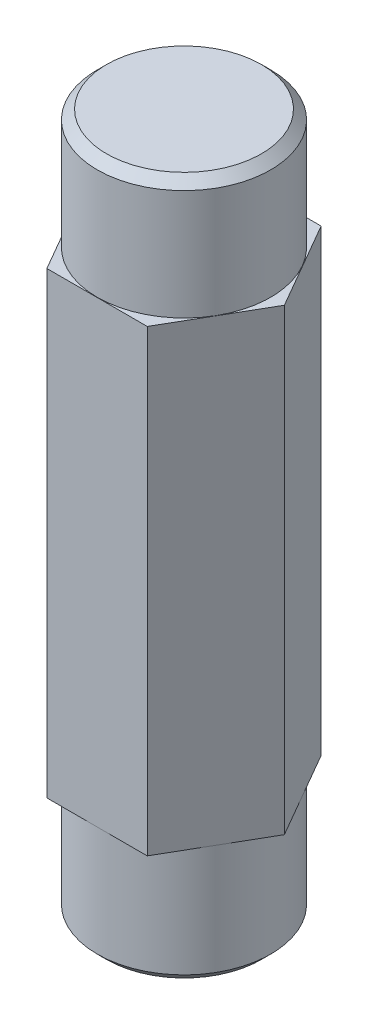
ISO-10303-21;
HEADER;
FILE_DESCRIPTION(('STEP AP214'),'2;1');
FILE_NAME('part.step','',(''),(''),'','','');
FILE_SCHEMA(('AUTOMOTIVE_DESIGN { 1 0 10303 214 1 1 1 1 }'));
ENDSEC;
DATA;
#1=APPLICATION_CONTEXT('core data for automotive mechanical design processes');
#2=APPLICATION_PROTOCOL_DEFINITION('international standard','automotive_design',2000,#1);
#3=PRODUCT_CONTEXT('',#1,'mechanical');
#4=PRODUCT('Part','Part','',(#3));
#5=PRODUCT_RELATED_PRODUCT_CATEGORY('part','',(#4));
#6=PRODUCT_DEFINITION_FORMATION('','',#4);
#7=PRODUCT_DEFINITION_CONTEXT('part definition',#1,'design');
#8=PRODUCT_DEFINITION('design','',#6,#7);
#9=PRODUCT_DEFINITION_SHAPE('','',#8);
#10=(LENGTH_UNIT() NAMED_UNIT(*) SI_UNIT(.MILLI.,.METRE.));
#11=(NAMED_UNIT(*) PLANE_ANGLE_UNIT() SI_UNIT($,.RADIAN.));
#12=(NAMED_UNIT(*) SI_UNIT($,.STERADIAN.) SOLID_ANGLE_UNIT());
#13=UNCERTAINTY_MEASURE_WITH_UNIT(LENGTH_MEASURE(1.E-05),#10,'distance_accuracy_value','');
#14=(GEOMETRIC_REPRESENTATION_CONTEXT(3) GLOBAL_UNCERTAINTY_ASSIGNED_CONTEXT((#13)) GLOBAL_UNIT_ASSIGNED_CONTEXT((#10,
#11,#12)) REPRESENTATION_CONTEXT('',''));
#15=CARTESIAN_POINT('',(0.,0.,0.));
#16=DIRECTION('',(0.,0.,1.));
#17=DIRECTION('',(1.,0.,0.));
#18=AXIS2_PLACEMENT_3D('',#15,#16,#17);
#19=CARTESIAN_POINT('',(-44.7233856342443,-25.527,-16.6661167863655));
#20=DIRECTION('',(-0.866025403784439,0.,0.5));
#21=DIRECTION('',(0.5,0.,0.866025403784439));
#22=AXIS2_PLACEMENT_3D('',#19,#20,#21);
#23=PLANE('',#22);
#24=DIRECTION('',(0.,1.,0.));
#25=VECTOR('',#24,1.);
#26=CARTESIAN_POINT('',(-41.9737549772287,-25.527,-11.9036167863655));
#27=LINE('',#26,#25);
#28=CARTESIAN_POINT('',(-41.9737549772287,-25.3238,-11.9036167863655));
#29=VERTEX_POINT('',#28);
#30=CARTESIAN_POINT('',(-41.9737549772287,-0.2032,-11.9036167863655));
#31=VERTEX_POINT('',#30);
#32=EDGE_CURVE('E115',#29,#31,#27,.T.);
#33=ORIENTED_EDGE('',*,*,#32,.T.);
#34=DIRECTION('',(0.5,0.,0.866025403784439));
#35=VECTOR('',#34,1.);
#36=CARTESIAN_POINT('',(-44.7233856342443,-0.2032,-16.6661167863655));
#37=LINE('',#36,#35);
#38=CARTESIAN_POINT('',(-44.7233856342443,-0.2032,-16.6661167863655));
#39=VERTEX_POINT('',#38);
#40=EDGE_CURVE('E102',#39,#31,#37,.T.);
#41=ORIENTED_EDGE('',*,*,#40,.F.);
#42=DIRECTION('',(0.,1.,0.));
#43=VECTOR('',#42,1.);
#44=CARTESIAN_POINT('',(-44.7233856342443,-25.527,-16.6661167863655));
#45=LINE('',#44,#43);
#46=CARTESIAN_POINT('',(-44.7233856342443,-25.3238,-16.6661167863655));
#47=VERTEX_POINT('',#46);
#48=EDGE_CURVE('E113',#47,#39,#45,.T.);
#49=ORIENTED_EDGE('',*,*,#48,.F.);
#50=DIRECTION('',(-0.5,0.,-0.866025403784439));
#51=VECTOR('',#50,1.);
#52=CARTESIAN_POINT('',(-41.9737549772287,-25.3238,-11.9036167863655));
#53=LINE('',#52,#51);
#54=EDGE_CURVE('E72',#29,#47,#53,.T.);
#55=ORIENTED_EDGE('',*,*,#54,.F.);
#56=EDGE_LOOP('',(#33,#41,#49,#55));
#57=FACE_BOUND('',#56,.T.);
#58=ADVANCED_FACE('F50',(#57),#23,.T.);
#59=CARTESIAN_POINT('',(-41.9737549772287,-25.527,-11.9036167863655));
#60=DIRECTION('',(0.,0.,1.));
#61=DIRECTION('',(1.,0.,0.));
#62=AXIS2_PLACEMENT_3D('',#59,#60,#61);
#63=PLANE('',#62);
#64=DIRECTION('',(0.,1.,0.));
#65=VECTOR('',#64,1.);
#66=CARTESIAN_POINT('',(-36.4744936631975,-25.527,-11.9036167863655));
#67=LINE('',#66,#65);
#68=CARTESIAN_POINT('',(-36.4744936631975,-25.3238,-11.9036167863655));
#69=VERTEX_POINT('',#68);
#70=CARTESIAN_POINT('',(-36.4744936631975,-0.2032,-11.9036167863655));
#71=VERTEX_POINT('',#70);
#72=EDGE_CURVE('E134',#69,#71,#67,.T.);
#73=ORIENTED_EDGE('',*,*,#72,.T.);
#74=DIRECTION('',(1.,0.,0.));
#75=VECTOR('',#74,1.);
#76=CARTESIAN_POINT('',(-41.9737549772287,-0.2032,-11.9036167863655));
#77=LINE('',#76,#75);
#78=EDGE_CURVE('E116',#31,#71,#77,.T.);
#79=ORIENTED_EDGE('',*,*,#78,.F.);
#80=ORIENTED_EDGE('',*,*,#32,.F.);
#81=DIRECTION('',(-1.,0.,0.));
#82=VECTOR('',#81,1.);
#83=CARTESIAN_POINT('',(-36.4744936631975,-25.3238,-11.9036167863655));
#84=LINE('',#83,#82);
#85=EDGE_CURVE('E218',#69,#29,#84,.T.);
#86=ORIENTED_EDGE('',*,*,#85,.F.);
#87=EDGE_LOOP('',(#73,#79,#80,#86));
#88=FACE_BOUND('',#87,.T.);
#89=ADVANCED_FACE('F166',(#88),#63,.T.);
#90=CARTESIAN_POINT('',(-36.4744936631975,-25.527,-11.9036167863655));
#91=DIRECTION('',(0.866025403784438,0.,0.500000000000001));
#92=DIRECTION('',(0.500000000000001,0.,-0.866025403784438));
#93=AXIS2_PLACEMENT_3D('',#90,#91,#92);
#94=PLANE('',#93);
#95=DIRECTION('',(0.,1.,0.));
#96=VECTOR('',#95,1.);
#97=CARTESIAN_POINT('',(-33.7248630061819,-25.527,-16.6661167863655));
#98=LINE('',#97,#96);
#99=CARTESIAN_POINT('',(-33.7248630061819,-25.3238,-16.6661167863655));
#100=VERTEX_POINT('',#99);
#101=CARTESIAN_POINT('',(-33.7248630061819,-0.2032,-16.6661167863655));
#102=VERTEX_POINT('',#101);
#103=EDGE_CURVE('E131',#100,#102,#98,.T.);
#104=ORIENTED_EDGE('',*,*,#103,.T.);
#105=DIRECTION('',(0.500000000000001,0.,-0.866025403784438));
#106=VECTOR('',#105,1.);
#107=CARTESIAN_POINT('',(-36.4744936631975,-0.2032,-11.9036167863655));
#108=LINE('',#107,#106);
#109=EDGE_CURVE('E210',#71,#102,#108,.T.);
#110=ORIENTED_EDGE('',*,*,#109,.F.);
#111=ORIENTED_EDGE('',*,*,#72,.F.);
#112=DIRECTION('',(-0.500000000000001,0.,0.866025403784438));
#113=VECTOR('',#112,1.);
#114=CARTESIAN_POINT('',(-33.7248630061819,-25.3238,-16.6661167863655));
#115=LINE('',#114,#113);
#116=EDGE_CURVE('E121',#100,#69,#115,.T.);
#117=ORIENTED_EDGE('',*,*,#116,.F.);
#118=EDGE_LOOP('',(#104,#110,#111,#117));
#119=FACE_BOUND('',#118,.T.);
#120=ADVANCED_FACE('F170',(#119),#94,.T.);
#121=CARTESIAN_POINT('',(-33.7248630061819,-25.527,-16.6661167863655));
#122=DIRECTION('',(0.866025403784439,0.,-0.5));
#123=DIRECTION('',(-0.5,0.,-0.866025403784439));
#124=AXIS2_PLACEMENT_3D('',#121,#122,#123);
#125=PLANE('',#124);
#126=DIRECTION('',(0.,1.,0.));
#127=VECTOR('',#126,1.);
#128=CARTESIAN_POINT('',(-36.4744936631975,-25.527,-21.4286167863655));
#129=LINE('',#128,#127);
#130=CARTESIAN_POINT('',(-36.4744936631975,-25.3238,-21.4286167863655));
#131=VERTEX_POINT('',#130);
#132=CARTESIAN_POINT('',(-36.4744936631975,-0.2032,-21.4286167863655));
#133=VERTEX_POINT('',#132);
#134=EDGE_CURVE('E123',#131,#133,#129,.T.);
#135=ORIENTED_EDGE('',*,*,#134,.T.);
#136=DIRECTION('',(-0.5,0.,-0.866025403784439));
#137=VECTOR('',#136,1.);
#138=CARTESIAN_POINT('',(-33.7248630061819,-0.2032,-16.6661167863655));
#139=LINE('',#138,#137);
#140=EDGE_CURVE('E212',#102,#133,#139,.T.);
#141=ORIENTED_EDGE('',*,*,#140,.F.);
#142=ORIENTED_EDGE('',*,*,#103,.F.);
#143=DIRECTION('',(0.5,0.,0.866025403784439));
#144=VECTOR('',#143,1.);
#145=CARTESIAN_POINT('',(-36.4744936631975,-25.3238,-21.4286167863655));
#146=LINE('',#145,#144);
#147=EDGE_CURVE('E125',#131,#100,#146,.T.);
#148=ORIENTED_EDGE('',*,*,#147,.F.);
#149=EDGE_LOOP('',(#135,#141,#142,#148));
#150=FACE_BOUND('',#149,.T.);
#151=ADVANCED_FACE('F175',(#150),#125,.T.);
#152=CARTESIAN_POINT('',(-36.4744936631975,-25.527,-21.4286167863655));
#153=DIRECTION('',(0.,0.,-1.));
#154=DIRECTION('',(-1.,0.,0.));
#155=AXIS2_PLACEMENT_3D('',#152,#153,#154);
#156=PLANE('',#155);
#157=DIRECTION('',(0.,1.,0.));
#158=VECTOR('',#157,1.);
#159=CARTESIAN_POINT('',(-41.9737549772287,-25.527,-21.4286167863655));
#160=LINE('',#159,#158);
#161=CARTESIAN_POINT('',(-41.9737549772287,-25.3238,-21.4286167863655));
#162=VERTEX_POINT('',#161);
#163=CARTESIAN_POINT('',(-41.9737549772287,-0.203200000000001,-21.4286167863655));
#164=VERTEX_POINT('',#163);
#165=EDGE_CURVE('E120',#162,#164,#160,.T.);
#166=ORIENTED_EDGE('',*,*,#165,.T.);
#167=DIRECTION('',(-1.,0.,0.));
#168=VECTOR('',#167,1.);
#169=CARTESIAN_POINT('',(-36.4744936631975,-0.2032,-21.4286167863655));
#170=LINE('',#169,#168);
#171=EDGE_CURVE('E64',#133,#164,#170,.T.);
#172=ORIENTED_EDGE('',*,*,#171,.F.);
#173=ORIENTED_EDGE('',*,*,#134,.F.);
#174=DIRECTION('',(1.,0.,0.));
#175=VECTOR('',#174,1.);
#176=CARTESIAN_POINT('',(-41.9737549772287,-25.3238,-21.4286167863655));
#177=LINE('',#176,#175);
#178=EDGE_CURVE('E222',#162,#131,#177,.T.);
#179=ORIENTED_EDGE('',*,*,#178,.F.);
#180=EDGE_LOOP('',(#166,#172,#173,#179));
#181=FACE_BOUND('',#180,.T.);
#182=ADVANCED_FACE('F181',(#181),#156,.T.);
#183=CARTESIAN_POINT('',(-41.9737549772287,-25.527,-21.4286167863655));
#184=DIRECTION('',(-0.866025403784438,0.,-0.500000000000001));
#185=DIRECTION('',(-0.500000000000001,0.,0.866025403784438));
#186=AXIS2_PLACEMENT_3D('',#183,#184,#185);
#187=PLANE('',#186);
#188=ORIENTED_EDGE('',*,*,#48,.T.);
#189=DIRECTION('',(-0.500000000000001,0.,0.866025403784438));
#190=VECTOR('',#189,1.);
#191=CARTESIAN_POINT('',(-41.9737549772287,-0.2032,-21.4286167863655));
#192=LINE('',#191,#190);
#193=EDGE_CURVE('E99',#164,#39,#192,.T.);
#194=ORIENTED_EDGE('',*,*,#193,.F.);
#195=ORIENTED_EDGE('',*,*,#165,.F.);
#196=DIRECTION('',(0.500000000000001,0.,-0.866025403784438));
#197=VECTOR('',#196,1.);
#198=CARTESIAN_POINT('',(-44.7233856342443,-25.3238,-16.6661167863655));
#199=LINE('',#198,#197);
#200=EDGE_CURVE('E119',#47,#162,#199,.T.);
#201=ORIENTED_EDGE('',*,*,#200,.F.);
#202=EDGE_LOOP('',(#188,#194,#195,#201));
#203=FACE_BOUND('',#202,.T.);
#204=ADVANCED_FACE('F118',(#203),#187,.T.);
#205=CARTESIAN_POINT('',(-41.9737549772287,-25.3238,-11.9036167863655));
#206=DIRECTION('',(0.,-1.,0.));
#207=DIRECTION('',(0.,0.,-1.));
#208=AXIS2_PLACEMENT_3D('',#205,#206,#207);
#209=PLANE('',#208);
#210=CARTESIAN_POINT('',(-39.2241243202131,-25.3238,-16.6661167863655));
#211=DIRECTION('',(0.,-1.,0.));
#212=DIRECTION('',(0.,0.,-1.));
#213=AXIS2_PLACEMENT_3D('',#210,#211,#212);
#214=CIRCLE('',#213,4.7498);
#215=CARTESIAN_POINT('',(-39.2241243202131,-25.3238,-21.4159167863655));
#216=VERTEX_POINT('',#215);
#217=EDGE_CURVE('E215',#216,#216,#214,.T.);
#218=ORIENTED_EDGE('',*,*,#217,.F.);
#219=EDGE_LOOP('',(#218));
#220=FACE_BOUND('',#219,.T.);
#221=ORIENTED_EDGE('',*,*,#85,.T.);
#222=ORIENTED_EDGE('',*,*,#54,.T.);
#223=ORIENTED_EDGE('',*,*,#200,.T.);
#224=ORIENTED_EDGE('',*,*,#178,.T.);
#225=ORIENTED_EDGE('',*,*,#147,.T.);
#226=ORIENTED_EDGE('',*,*,#116,.T.);
#227=EDGE_LOOP('',(#221,#222,#223,#224,#225,#226));
#228=FACE_BOUND('',#227,.T.);
#229=ADVANCED_FACE('F159',(#220,#228),#209,.T.);
#230=CARTESIAN_POINT('',(-39.2241243202131,-31.877,-16.6661167863655));
#231=DIRECTION('',(0.,1.,0.));
#232=DIRECTION('',(0.,0.,1.));
#233=AXIS2_PLACEMENT_3D('',#230,#231,#232);
#234=PLANE('',#233);
#235=CARTESIAN_POINT('',(-39.2241243202131,-31.877,-16.6661167863655));
#236=DIRECTION('',(0.,1.,0.));
#237=DIRECTION('',(0.,0.,1.));
#238=AXIS2_PLACEMENT_3D('',#235,#236,#237);
#239=CIRCLE('',#238,4.2418);
#240=CARTESIAN_POINT('',(-39.2241243202131,-31.877,-12.4243167863655));
#241=VERTEX_POINT('',#240);
#242=EDGE_CURVE('E11',#241,#241,#239,.F.);
#243=ORIENTED_EDGE('',*,*,#242,.T.);
#244=EDGE_LOOP('',(#243));
#245=FACE_BOUND('',#244,.T.);
#246=ADVANCED_FACE('F151',(#245),#234,.F.);
#247=CARTESIAN_POINT('',(-39.2241243202131,-31.369,-16.6661167863655));
#248=DIRECTION('',(0.,1.,0.));
#249=DIRECTION('',(0.,0.,1.));
#250=AXIS2_PLACEMENT_3D('',#247,#248,#249);
#251=CONICAL_SURFACE('',#250,4.7498,0.78539816339745);
#252=ORIENTED_EDGE('',*,*,#242,.F.);
#253=EDGE_LOOP('',(#252));
#254=FACE_BOUND('',#253,.T.);
#255=CARTESIAN_POINT('',(-39.2241243202131,-31.369,-16.6661167863655));
#256=DIRECTION('',(0.,1.,0.));
#257=DIRECTION('',(0.,0.,1.));
#258=AXIS2_PLACEMENT_3D('',#255,#256,#257);
#259=CIRCLE('',#258,4.7498);
#260=CARTESIAN_POINT('',(-39.2241243202131,-31.369,-11.9163167863655));
#261=VERTEX_POINT('',#260);
#262=EDGE_CURVE('E57',#261,#261,#259,.T.);
#263=ORIENTED_EDGE('',*,*,#262,.F.);
#264=EDGE_LOOP('',(#263));
#265=FACE_BOUND('',#264,.T.);
#266=ADVANCED_FACE('F149',(#254,#265),#251,.T.);
#267=CARTESIAN_POINT('',(-39.2241243202131,-31.877,-16.6661167863655));
#268=DIRECTION('',(0.,1.,0.));
#269=DIRECTION('',(0.,0.,1.));
#270=AXIS2_PLACEMENT_3D('',#267,#268,#269);
#271=CYLINDRICAL_SURFACE('',#270,4.7498);
#272=ORIENTED_EDGE('',*,*,#262,.T.);
#273=EDGE_LOOP('',(#272));
#274=FACE_BOUND('',#273,.T.);
#275=ORIENTED_EDGE('',*,*,#217,.T.);
#276=EDGE_LOOP('',(#275));
#277=FACE_BOUND('',#276,.T.);
#278=ADVANCED_FACE('F146',(#274,#277),#271,.T.);
#279=CARTESIAN_POINT('',(-44.7233856342443,-0.2032,-16.6661167863655));
#280=DIRECTION('',(0.,1.,0.));
#281=DIRECTION('',(0.,0.,1.));
#282=AXIS2_PLACEMENT_3D('',#279,#280,#281);
#283=PLANE('',#282);
#284=CARTESIAN_POINT('',(-39.2241243202131,-0.2032,-16.6661167863655));
#285=DIRECTION('',(0.,1.,0.));
#286=DIRECTION('',(0.,0.,1.));
#287=AXIS2_PLACEMENT_3D('',#284,#285,#286);
#288=CIRCLE('',#287,4.7498);
#289=CARTESIAN_POINT('',(-39.2241243202131,-0.2032,-11.9163167863655));
#290=VERTEX_POINT('',#289);
#291=EDGE_CURVE('E108',#290,#290,#288,.T.);
#292=ORIENTED_EDGE('',*,*,#291,.F.);
#293=EDGE_LOOP('',(#292));
#294=FACE_BOUND('',#293,.T.);
#295=ORIENTED_EDGE('',*,*,#193,.T.);
#296=ORIENTED_EDGE('',*,*,#40,.T.);
#297=ORIENTED_EDGE('',*,*,#78,.T.);
#298=ORIENTED_EDGE('',*,*,#109,.T.);
#299=ORIENTED_EDGE('',*,*,#140,.T.);
#300=ORIENTED_EDGE('',*,*,#171,.T.);
#301=EDGE_LOOP('',(#295,#296,#297,#298,#299,#300));
#302=FACE_BOUND('',#301,.T.);
#303=ADVANCED_FACE('F101',(#294,#302),#283,.T.);
#304=CARTESIAN_POINT('',(-39.2241243202131,6.35,-16.6661167863655));
#305=DIRECTION('',(0.,-1.,0.));
#306=DIRECTION('',(0.,0.,-1.));
#307=AXIS2_PLACEMENT_3D('',#304,#305,#306);
#308=PLANE('',#307);
#309=CARTESIAN_POINT('',(-39.2241243202131,6.35,-16.6661167863655));
#310=DIRECTION('',(0.,-1.,0.));
#311=DIRECTION('',(0.,0.,-1.));
#312=AXIS2_PLACEMENT_3D('',#309,#310,#311);
#313=CIRCLE('',#312,4.2418);
#314=CARTESIAN_POINT('',(-39.2241243202131,6.35,-20.9079167863655));
#315=VERTEX_POINT('',#314);
#316=EDGE_CURVE('E141',#315,#315,#313,.F.);
#317=ORIENTED_EDGE('',*,*,#316,.T.);
#318=EDGE_LOOP('',(#317));
#319=FACE_BOUND('',#318,.T.);
#320=ADVANCED_FACE('F193',(#319),#308,.F.);
#321=CARTESIAN_POINT('',(-39.2241243202131,5.842,-16.6661167863655));
#322=DIRECTION('',(0.,-1.,0.));
#323=DIRECTION('',(0.,0.,-1.));
#324=AXIS2_PLACEMENT_3D('',#321,#322,#323);
#325=CONICAL_SURFACE('',#324,4.7498,0.785398163397452);
#326=ORIENTED_EDGE('',*,*,#316,.F.);
#327=EDGE_LOOP('',(#326));
#328=FACE_BOUND('',#327,.T.);
#329=CARTESIAN_POINT('',(-39.2241243202131,5.842,-16.6661167863655));
#330=DIRECTION('',(0.,-1.,0.));
#331=DIRECTION('',(0.,0.,-1.));
#332=AXIS2_PLACEMENT_3D('',#329,#330,#331);
#333=CIRCLE('',#332,4.7498);
#334=CARTESIAN_POINT('',(-39.2241243202131,5.842,-21.4159167863655));
#335=VERTEX_POINT('',#334);
#336=EDGE_CURVE('E138',#335,#335,#333,.T.);
#337=ORIENTED_EDGE('',*,*,#336,.F.);
#338=EDGE_LOOP('',(#337));
#339=FACE_BOUND('',#338,.T.);
#340=ADVANCED_FACE('F191',(#328,#339),#325,.T.);
#341=CARTESIAN_POINT('',(-39.2241243202131,6.35,-16.6661167863655));
#342=DIRECTION('',(0.,-1.,0.));
#343=DIRECTION('',(0.,0.,-1.));
#344=AXIS2_PLACEMENT_3D('',#341,#342,#343);
#345=CYLINDRICAL_SURFACE('',#344,4.7498);
#346=ORIENTED_EDGE('',*,*,#336,.T.);
#347=EDGE_LOOP('',(#346));
#348=FACE_BOUND('',#347,.T.);
#349=ORIENTED_EDGE('',*,*,#291,.T.);
#350=EDGE_LOOP('',(#349));
#351=FACE_BOUND('',#350,.T.);
#352=ADVANCED_FACE('F188',(#348,#351),#345,.T.);
#353=CLOSED_SHELL('',(#58,#89,#120,#151,#182,#204,#229,#246,#266,#278,#303,#320,#340,#352));
#354=MANIFOLD_SOLID_BREP('B2',#353);
#355=ADVANCED_BREP_SHAPE_REPRESENTATION('',(#18,#354),#14);
#356=SHAPE_DEFINITION_REPRESENTATION(#9,#355);
ENDSEC;
END-ISO-10303-21;
